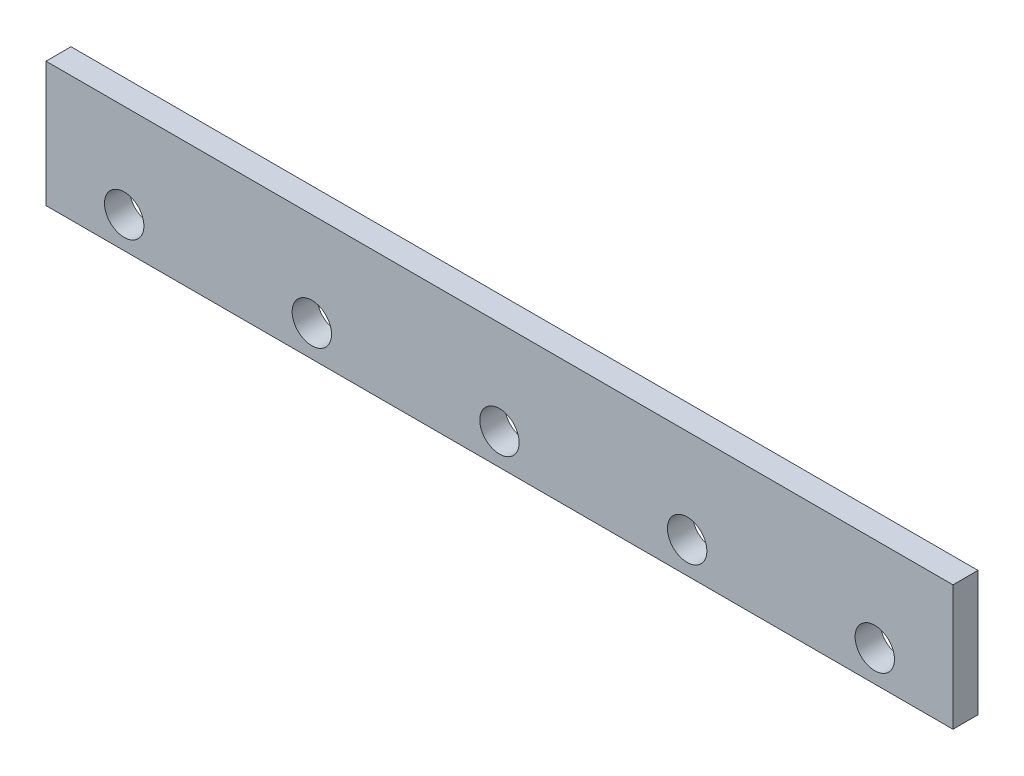
ISO-10303-21;
HEADER;
FILE_DESCRIPTION(('STEP AP214'),'2;1');
FILE_NAME('part.step','',(''),(''),'','','');
FILE_SCHEMA(('AUTOMOTIVE_DESIGN { 1 0 10303 214 1 1 1 1 }'));
ENDSEC;
DATA;
#1=APPLICATION_CONTEXT('core data for automotive mechanical design processes');
#2=APPLICATION_PROTOCOL_DEFINITION('international standard','automotive_design',2000,#1);
#3=PRODUCT_CONTEXT('',#1,'mechanical');
#4=PRODUCT('Part','Part','',(#3));
#5=PRODUCT_RELATED_PRODUCT_CATEGORY('part','',(#4));
#6=PRODUCT_DEFINITION_FORMATION('','',#4);
#7=PRODUCT_DEFINITION_CONTEXT('part definition',#1,'design');
#8=PRODUCT_DEFINITION('design','',#6,#7);
#9=PRODUCT_DEFINITION_SHAPE('','',#8);
#10=(LENGTH_UNIT() NAMED_UNIT(*) SI_UNIT(.MILLI.,.METRE.));
#11=(NAMED_UNIT(*) PLANE_ANGLE_UNIT() SI_UNIT($,.RADIAN.));
#12=(NAMED_UNIT(*) SI_UNIT($,.STERADIAN.) SOLID_ANGLE_UNIT());
#13=UNCERTAINTY_MEASURE_WITH_UNIT(LENGTH_MEASURE(1.E-05),#10,'distance_accuracy_value','');
#14=(GEOMETRIC_REPRESENTATION_CONTEXT(3) GLOBAL_UNCERTAINTY_ASSIGNED_CONTEXT((#13)) GLOBAL_UNIT_ASSIGNED_CONTEXT((#10,
#11,#12)) REPRESENTATION_CONTEXT('',''));
#15=CARTESIAN_POINT('',(0.,0.,0.));
#16=DIRECTION('',(0.,0.,1.));
#17=DIRECTION('',(1.,0.,0.));
#18=AXIS2_PLACEMENT_3D('',#15,#16,#17);
#19=CARTESIAN_POINT('',(0.,0.,16.));
#20=DIRECTION('',(1.,0.,0.));
#21=DIRECTION('',(0.,0.,-1.));
#22=AXIS2_PLACEMENT_3D('',#19,#20,#21);
#23=PLANE('',#22);
#24=DIRECTION('',(0.,-1.,0.));
#25=VECTOR('',#24,1.);
#26=CARTESIAN_POINT('',(0.,0.,0.));
#27=LINE('',#26,#25);
#28=CARTESIAN_POINT('',(0.,80.,0.));
#29=VERTEX_POINT('',#28);
#30=CARTESIAN_POINT('',(0.,0.,0.));
#31=VERTEX_POINT('',#30);
#32=EDGE_CURVE('E96',#29,#31,#27,.T.);
#33=ORIENTED_EDGE('',*,*,#32,.T.);
#34=DIRECTION('',(0.,0.,-1.));
#35=VECTOR('',#34,1.);
#36=CARTESIAN_POINT('',(0.,0.,16.));
#37=LINE('',#36,#35);
#38=CARTESIAN_POINT('',(0.,0.,16.));
#39=VERTEX_POINT('',#38);
#40=EDGE_CURVE('E11',#39,#31,#37,.T.);
#41=ORIENTED_EDGE('',*,*,#40,.F.);
#42=DIRECTION('',(0.,-1.,0.));
#43=VECTOR('',#42,1.);
#44=CARTESIAN_POINT('',(0.,0.,16.));
#45=LINE('',#44,#43);
#46=CARTESIAN_POINT('',(0.,80.,16.));
#47=VERTEX_POINT('',#46);
#48=EDGE_CURVE('E84',#47,#39,#45,.T.);
#49=ORIENTED_EDGE('',*,*,#48,.F.);
#50=DIRECTION('',(0.,0.,-1.));
#51=VECTOR('',#50,1.);
#52=CARTESIAN_POINT('',(0.,80.,16.));
#53=LINE('',#52,#51);
#54=EDGE_CURVE('E92',#47,#29,#53,.T.);
#55=ORIENTED_EDGE('',*,*,#54,.T.);
#56=EDGE_LOOP('',(#33,#41,#49,#55));
#57=FACE_BOUND('',#56,.T.);
#58=ADVANCED_FACE('F33',(#57),#23,.F.);
#59=CARTESIAN_POINT('',(0.,0.,16.));
#60=DIRECTION('',(0.,1.,0.));
#61=DIRECTION('',(0.,0.,1.));
#62=AXIS2_PLACEMENT_3D('',#59,#60,#61);
#63=PLANE('',#62);
#64=DIRECTION('',(1.,0.,0.));
#65=VECTOR('',#64,1.);
#66=CARTESIAN_POINT('',(0.,0.,0.));
#67=LINE('',#66,#65);
#68=CARTESIAN_POINT('',(580.,0.,0.));
#69=VERTEX_POINT('',#68);
#70=EDGE_CURVE('E88',#31,#69,#67,.T.);
#71=ORIENTED_EDGE('',*,*,#70,.T.);
#72=DIRECTION('',(0.,0.,-1.));
#73=VECTOR('',#72,1.);
#74=CARTESIAN_POINT('',(580.,0.,16.));
#75=LINE('',#74,#73);
#76=CARTESIAN_POINT('',(580.,0.,16.));
#77=VERTEX_POINT('',#76);
#78=EDGE_CURVE('E41',#77,#69,#75,.T.);
#79=ORIENTED_EDGE('',*,*,#78,.F.);
#80=DIRECTION('',(1.,0.,0.));
#81=VECTOR('',#80,1.);
#82=CARTESIAN_POINT('',(0.,0.,16.));
#83=LINE('',#82,#81);
#84=EDGE_CURVE('E79',#39,#77,#83,.T.);
#85=ORIENTED_EDGE('',*,*,#84,.F.);
#86=ORIENTED_EDGE('',*,*,#40,.T.);
#87=EDGE_LOOP('',(#71,#79,#85,#86));
#88=FACE_BOUND('',#87,.T.);
#89=ADVANCED_FACE('F87',(#88),#63,.F.);
#90=CARTESIAN_POINT('',(580.,0.,16.));
#91=DIRECTION('',(-1.,0.,0.));
#92=DIRECTION('',(0.,0.,1.));
#93=AXIS2_PLACEMENT_3D('',#90,#91,#92);
#94=PLANE('',#93);
#95=DIRECTION('',(0.,1.,0.));
#96=VECTOR('',#95,1.);
#97=CARTESIAN_POINT('',(580.,0.,0.));
#98=LINE('',#97,#96);
#99=CARTESIAN_POINT('',(580.,80.,0.));
#100=VERTEX_POINT('',#99);
#101=EDGE_CURVE('E66',#69,#100,#98,.T.);
#102=ORIENTED_EDGE('',*,*,#101,.T.);
#103=DIRECTION('',(0.,0.,-1.));
#104=VECTOR('',#103,1.);
#105=CARTESIAN_POINT('',(580.,80.,16.));
#106=LINE('',#105,#104);
#107=CARTESIAN_POINT('',(580.,80.,16.));
#108=VERTEX_POINT('',#107);
#109=EDGE_CURVE('E89',#108,#100,#106,.T.);
#110=ORIENTED_EDGE('',*,*,#109,.F.);
#111=DIRECTION('',(0.,1.,0.));
#112=VECTOR('',#111,1.);
#113=CARTESIAN_POINT('',(580.,0.,16.));
#114=LINE('',#113,#112);
#115=EDGE_CURVE('E82',#77,#108,#114,.T.);
#116=ORIENTED_EDGE('',*,*,#115,.F.);
#117=ORIENTED_EDGE('',*,*,#78,.T.);
#118=EDGE_LOOP('',(#102,#110,#116,#117));
#119=FACE_BOUND('',#118,.T.);
#120=ADVANCED_FACE('F90',(#119),#94,.F.);
#121=CARTESIAN_POINT('',(0.,80.,16.));
#122=DIRECTION('',(0.,-1.,0.));
#123=DIRECTION('',(0.,0.,-1.));
#124=AXIS2_PLACEMENT_3D('',#121,#122,#123);
#125=PLANE('',#124);
#126=DIRECTION('',(-1.,0.,0.));
#127=VECTOR('',#126,1.);
#128=CARTESIAN_POINT('',(0.,80.,0.));
#129=LINE('',#128,#127);
#130=EDGE_CURVE('E72',#100,#29,#129,.T.);
#131=ORIENTED_EDGE('',*,*,#130,.T.);
#132=ORIENTED_EDGE('',*,*,#54,.F.);
#133=DIRECTION('',(-1.,0.,0.));
#134=VECTOR('',#133,1.);
#135=CARTESIAN_POINT('',(0.,80.,16.));
#136=LINE('',#135,#134);
#137=EDGE_CURVE('E49',#108,#47,#136,.T.);
#138=ORIENTED_EDGE('',*,*,#137,.F.);
#139=ORIENTED_EDGE('',*,*,#109,.T.);
#140=EDGE_LOOP('',(#131,#132,#138,#139));
#141=FACE_BOUND('',#140,.T.);
#142=ADVANCED_FACE('F104',(#141),#125,.F.);
#143=CARTESIAN_POINT('',(0.,0.,16.));
#144=DIRECTION('',(0.,0.,-1.));
#145=DIRECTION('',(-1.,0.,0.));
#146=AXIS2_PLACEMENT_3D('',#143,#144,#145);
#147=PLANE('',#146);
#148=CARTESIAN_POINT('',(530.,20.0000000000001,16.));
#149=DIRECTION('',(0.,0.,1.));
#150=DIRECTION('',(1.,0.,0.));
#151=AXIS2_PLACEMENT_3D('',#148,#149,#150);
#152=CIRCLE('',#151,12.5999999999999);
#153=CARTESIAN_POINT('',(542.6,20.0000000000001,16.));
#154=VERTEX_POINT('',#153);
#155=EDGE_CURVE('E134',#154,#154,#152,.T.);
#156=ORIENTED_EDGE('',*,*,#155,.F.);
#157=EDGE_LOOP('',(#156));
#158=FACE_BOUND('',#157,.T.);
#159=CARTESIAN_POINT('',(410.,20.0000000000001,16.));
#160=DIRECTION('',(0.,0.,1.));
#161=DIRECTION('',(1.,0.,0.));
#162=AXIS2_PLACEMENT_3D('',#159,#160,#161);
#163=CIRCLE('',#162,12.6);
#164=CARTESIAN_POINT('',(422.6,20.0000000000001,16.));
#165=VERTEX_POINT('',#164);
#166=EDGE_CURVE('E128',#165,#165,#163,.T.);
#167=ORIENTED_EDGE('',*,*,#166,.F.);
#168=EDGE_LOOP('',(#167));
#169=FACE_BOUND('',#168,.T.);
#170=CARTESIAN_POINT('',(290.,20.0000000000001,16.));
#171=DIRECTION('',(0.,0.,1.));
#172=DIRECTION('',(1.,0.,0.));
#173=AXIS2_PLACEMENT_3D('',#170,#171,#172);
#174=CIRCLE('',#173,12.6);
#175=CARTESIAN_POINT('',(302.6,20.0000000000001,16.));
#176=VERTEX_POINT('',#175);
#177=EDGE_CURVE('E122',#176,#176,#174,.T.);
#178=ORIENTED_EDGE('',*,*,#177,.F.);
#179=EDGE_LOOP('',(#178));
#180=FACE_BOUND('',#179,.T.);
#181=CARTESIAN_POINT('',(170.,20.,16.));
#182=DIRECTION('',(0.,0.,1.));
#183=DIRECTION('',(1.,0.,0.));
#184=AXIS2_PLACEMENT_3D('',#181,#182,#183);
#185=CIRCLE('',#184,12.6);
#186=CARTESIAN_POINT('',(182.6,20.,16.));
#187=VERTEX_POINT('',#186);
#188=EDGE_CURVE('E116',#187,#187,#185,.T.);
#189=ORIENTED_EDGE('',*,*,#188,.F.);
#190=EDGE_LOOP('',(#189));
#191=FACE_BOUND('',#190,.T.);
#192=CARTESIAN_POINT('',(50.,20.,16.));
#193=DIRECTION('',(0.,0.,1.));
#194=DIRECTION('',(1.,0.,0.));
#195=AXIS2_PLACEMENT_3D('',#192,#193,#194);
#196=CIRCLE('',#195,12.6);
#197=CARTESIAN_POINT('',(62.6,20.,16.));
#198=VERTEX_POINT('',#197);
#199=EDGE_CURVE('E110',#198,#198,#196,.T.);
#200=ORIENTED_EDGE('',*,*,#199,.F.);
#201=EDGE_LOOP('',(#200));
#202=FACE_BOUND('',#201,.T.);
#203=ORIENTED_EDGE('',*,*,#48,.T.);
#204=ORIENTED_EDGE('',*,*,#84,.T.);
#205=ORIENTED_EDGE('',*,*,#115,.T.);
#206=ORIENTED_EDGE('',*,*,#137,.T.);
#207=EDGE_LOOP('',(#203,#204,#205,#206));
#208=FACE_BOUND('',#207,.T.);
#209=ADVANCED_FACE('F80',(#158,#169,#180,#191,#202,#208),#147,.F.);
#210=CARTESIAN_POINT('',(0.,0.,0.));
#211=DIRECTION('',(0.,0.,-1.));
#212=DIRECTION('',(-1.,0.,0.));
#213=AXIS2_PLACEMENT_3D('',#210,#211,#212);
#214=PLANE('',#213);
#215=CARTESIAN_POINT('',(530.,20.0000000000001,0.));
#216=DIRECTION('',(0.,0.,1.));
#217=DIRECTION('',(1.,0.,0.));
#218=AXIS2_PLACEMENT_3D('',#215,#216,#217);
#219=CIRCLE('',#218,12.5999999999999);
#220=CARTESIAN_POINT('',(542.6,20.0000000000001,0.));
#221=VERTEX_POINT('',#220);
#222=EDGE_CURVE('E131',#221,#221,#219,.T.);
#223=ORIENTED_EDGE('',*,*,#222,.T.);
#224=EDGE_LOOP('',(#223));
#225=FACE_BOUND('',#224,.T.);
#226=CARTESIAN_POINT('',(410.,20.0000000000001,0.));
#227=DIRECTION('',(0.,0.,1.));
#228=DIRECTION('',(1.,0.,0.));
#229=AXIS2_PLACEMENT_3D('',#226,#227,#228);
#230=CIRCLE('',#229,12.6);
#231=CARTESIAN_POINT('',(422.6,20.0000000000001,0.));
#232=VERTEX_POINT('',#231);
#233=EDGE_CURVE('E125',#232,#232,#230,.T.);
#234=ORIENTED_EDGE('',*,*,#233,.T.);
#235=EDGE_LOOP('',(#234));
#236=FACE_BOUND('',#235,.T.);
#237=CARTESIAN_POINT('',(290.,20.0000000000001,0.));
#238=DIRECTION('',(0.,0.,1.));
#239=DIRECTION('',(1.,0.,0.));
#240=AXIS2_PLACEMENT_3D('',#237,#238,#239);
#241=CIRCLE('',#240,12.6);
#242=CARTESIAN_POINT('',(302.6,20.0000000000001,0.));
#243=VERTEX_POINT('',#242);
#244=EDGE_CURVE('E119',#243,#243,#241,.T.);
#245=ORIENTED_EDGE('',*,*,#244,.T.);
#246=EDGE_LOOP('',(#245));
#247=FACE_BOUND('',#246,.T.);
#248=CARTESIAN_POINT('',(170.,20.,0.));
#249=DIRECTION('',(0.,0.,1.));
#250=DIRECTION('',(1.,0.,0.));
#251=AXIS2_PLACEMENT_3D('',#248,#249,#250);
#252=CIRCLE('',#251,12.6);
#253=CARTESIAN_POINT('',(182.6,20.,0.));
#254=VERTEX_POINT('',#253);
#255=EDGE_CURVE('E113',#254,#254,#252,.T.);
#256=ORIENTED_EDGE('',*,*,#255,.T.);
#257=EDGE_LOOP('',(#256));
#258=FACE_BOUND('',#257,.T.);
#259=CARTESIAN_POINT('',(50.,20.,0.));
#260=DIRECTION('',(0.,0.,1.));
#261=DIRECTION('',(1.,0.,0.));
#262=AXIS2_PLACEMENT_3D('',#259,#260,#261);
#263=CIRCLE('',#262,12.6);
#264=CARTESIAN_POINT('',(62.6,20.,0.));
#265=VERTEX_POINT('',#264);
#266=EDGE_CURVE('E99',#265,#265,#263,.T.);
#267=ORIENTED_EDGE('',*,*,#266,.T.);
#268=EDGE_LOOP('',(#267));
#269=FACE_BOUND('',#268,.T.);
#270=ORIENTED_EDGE('',*,*,#32,.F.);
#271=ORIENTED_EDGE('',*,*,#130,.F.);
#272=ORIENTED_EDGE('',*,*,#101,.F.);
#273=ORIENTED_EDGE('',*,*,#70,.F.);
#274=EDGE_LOOP('',(#270,#271,#272,#273));
#275=FACE_BOUND('',#274,.T.);
#276=ADVANCED_FACE('F107',(#225,#236,#247,#258,#269,#275),#214,.T.);
#277=CARTESIAN_POINT('',(50.,20.,0.));
#278=DIRECTION('',(0.,0.,1.));
#279=DIRECTION('',(1.,0.,0.));
#280=AXIS2_PLACEMENT_3D('',#277,#278,#279);
#281=CYLINDRICAL_SURFACE('',#280,12.6);
#282=ORIENTED_EDGE('',*,*,#266,.F.);
#283=EDGE_LOOP('',(#282));
#284=FACE_BOUND('',#283,.T.);
#285=ORIENTED_EDGE('',*,*,#199,.T.);
#286=EDGE_LOOP('',(#285));
#287=FACE_BOUND('',#286,.T.);
#288=ADVANCED_FACE('F160',(#284,#287),#281,.F.);
#289=CARTESIAN_POINT('',(170.,20.,0.));
#290=DIRECTION('',(0.,0.,1.));
#291=DIRECTION('',(1.,0.,0.));
#292=AXIS2_PLACEMENT_3D('',#289,#290,#291);
#293=CYLINDRICAL_SURFACE('',#292,12.6);
#294=ORIENTED_EDGE('',*,*,#255,.F.);
#295=EDGE_LOOP('',(#294));
#296=FACE_BOUND('',#295,.T.);
#297=ORIENTED_EDGE('',*,*,#188,.T.);
#298=EDGE_LOOP('',(#297));
#299=FACE_BOUND('',#298,.T.);
#300=ADVANCED_FACE('F162',(#296,#299),#293,.F.);
#301=CARTESIAN_POINT('',(290.,20.0000000000001,0.));
#302=DIRECTION('',(0.,0.,1.));
#303=DIRECTION('',(1.,0.,0.));
#304=AXIS2_PLACEMENT_3D('',#301,#302,#303);
#305=CYLINDRICAL_SURFACE('',#304,12.6);
#306=ORIENTED_EDGE('',*,*,#244,.F.);
#307=EDGE_LOOP('',(#306));
#308=FACE_BOUND('',#307,.T.);
#309=ORIENTED_EDGE('',*,*,#177,.T.);
#310=EDGE_LOOP('',(#309));
#311=FACE_BOUND('',#310,.T.);
#312=ADVANCED_FACE('F169',(#308,#311),#305,.F.);
#313=CARTESIAN_POINT('',(410.,20.0000000000001,0.));
#314=DIRECTION('',(0.,0.,1.));
#315=DIRECTION('',(1.,0.,0.));
#316=AXIS2_PLACEMENT_3D('',#313,#314,#315);
#317=CYLINDRICAL_SURFACE('',#316,12.6);
#318=ORIENTED_EDGE('',*,*,#233,.F.);
#319=EDGE_LOOP('',(#318));
#320=FACE_BOUND('',#319,.T.);
#321=ORIENTED_EDGE('',*,*,#166,.T.);
#322=EDGE_LOOP('',(#321));
#323=FACE_BOUND('',#322,.T.);
#324=ADVANCED_FACE('F145',(#320,#323),#317,.F.);
#325=CARTESIAN_POINT('',(530.,20.0000000000001,0.));
#326=DIRECTION('',(0.,0.,1.));
#327=DIRECTION('',(1.,0.,0.));
#328=AXIS2_PLACEMENT_3D('',#325,#326,#327);
#329=CYLINDRICAL_SURFACE('',#328,12.5999999999999);
#330=ORIENTED_EDGE('',*,*,#222,.F.);
#331=EDGE_LOOP('',(#330));
#332=FACE_BOUND('',#331,.T.);
#333=ORIENTED_EDGE('',*,*,#155,.T.);
#334=EDGE_LOOP('',(#333));
#335=FACE_BOUND('',#334,.T.);
#336=ADVANCED_FACE('F142',(#332,#335),#329,.F.);
#337=CLOSED_SHELL('',(#58,#89,#120,#142,#209,#276,#288,#300,#312,#324,#336));
#338=MANIFOLD_SOLID_BREP('B2',#337);
#339=ADVANCED_BREP_SHAPE_REPRESENTATION('',(#18,#338),#14);
#340=SHAPE_DEFINITION_REPRESENTATION(#9,#339);
ENDSEC;
END-ISO-10303-21;
